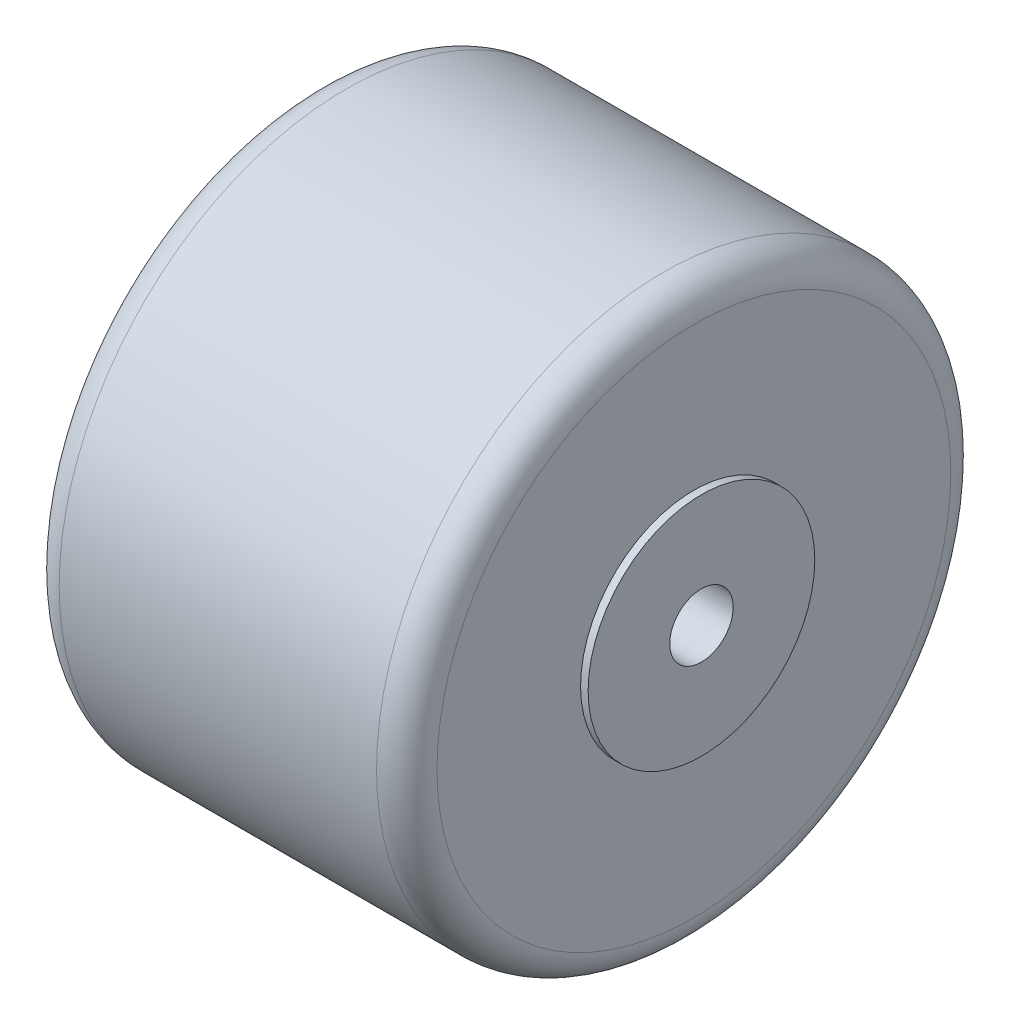
ISO-10303-21;
HEADER;
FILE_DESCRIPTION(('STEP AP214'),'2;1');
FILE_NAME('part.step','',(''),(''),'','','');
FILE_SCHEMA(('AUTOMOTIVE_DESIGN { 1 0 10303 214 1 1 1 1 }'));
ENDSEC;
DATA;
#1=APPLICATION_CONTEXT('core data for automotive mechanical design processes');
#2=APPLICATION_PROTOCOL_DEFINITION('international standard','automotive_design',2000,#1);
#3=PRODUCT_CONTEXT('',#1,'mechanical');
#4=PRODUCT('Part','Part','',(#3));
#5=PRODUCT_RELATED_PRODUCT_CATEGORY('part','',(#4));
#6=PRODUCT_DEFINITION_FORMATION('','',#4);
#7=PRODUCT_DEFINITION_CONTEXT('part definition',#1,'design');
#8=PRODUCT_DEFINITION('design','',#6,#7);
#9=PRODUCT_DEFINITION_SHAPE('','',#8);
#10=(LENGTH_UNIT() NAMED_UNIT(*) SI_UNIT(.MILLI.,.METRE.));
#11=(NAMED_UNIT(*) PLANE_ANGLE_UNIT() SI_UNIT($,.RADIAN.));
#12=(NAMED_UNIT(*) SI_UNIT($,.STERADIAN.) SOLID_ANGLE_UNIT());
#13=UNCERTAINTY_MEASURE_WITH_UNIT(LENGTH_MEASURE(1.E-05),#10,'distance_accuracy_value','');
#14=(GEOMETRIC_REPRESENTATION_CONTEXT(3) GLOBAL_UNCERTAINTY_ASSIGNED_CONTEXT((#13)) GLOBAL_UNIT_ASSIGNED_CONTEXT((#10,
#11,#12)) REPRESENTATION_CONTEXT('',''));
#15=CARTESIAN_POINT('',(0.,0.,0.));
#16=DIRECTION('',(0.,0.,1.));
#17=DIRECTION('',(1.,0.,0.));
#18=AXIS2_PLACEMENT_3D('',#15,#16,#17);
#19=CARTESIAN_POINT('',(26.,0.,0.));
#20=DIRECTION('',(-1.,0.,0.));
#21=DIRECTION('',(0.,0.,1.));
#22=AXIS2_PLACEMENT_3D('',#19,#20,#21);
#23=PLANE('',#22);
#24=CARTESIAN_POINT('',(26.,0.,0.));
#25=DIRECTION('',(1.,0.,0.));
#26=DIRECTION('',(0.,0.,-1.));
#27=AXIS2_PLACEMENT_3D('',#24,#25,#26);
#28=CIRCLE('',#27,2.09999999999999);
#29=CARTESIAN_POINT('',(26.,0.,-2.09999999999999));
#30=VERTEX_POINT('',#29);
#31=EDGE_CURVE('E61',#30,#30,#28,.T.);
#32=ORIENTED_EDGE('',*,*,#31,.F.);
#33=EDGE_LOOP('',(#32));
#34=FACE_BOUND('',#33,.T.);
#35=CARTESIAN_POINT('',(26.,0.,0.));
#36=DIRECTION('',(-1.,0.,0.));
#37=DIRECTION('',(0.,0.,1.));
#38=AXIS2_PLACEMENT_3D('',#35,#36,#37);
#39=CIRCLE('',#38,7.5);
#40=CARTESIAN_POINT('',(26.,0.,7.5));
#41=VERTEX_POINT('',#40);
#42=EDGE_CURVE('E57',#41,#41,#39,.T.);
#43=ORIENTED_EDGE('',*,*,#42,.F.);
#44=EDGE_LOOP('',(#43));
#45=FACE_BOUND('',#44,.T.);
#46=ADVANCED_FACE('F37',(#34,#45),#23,.F.);
#47=CARTESIAN_POINT('',(0.,0.,0.));
#48=DIRECTION('',(-1.,0.,0.));
#49=DIRECTION('',(0.,0.,1.));
#50=AXIS2_PLACEMENT_3D('',#47,#48,#49);
#51=CYLINDRICAL_SURFACE('',#50,7.5);
#52=CARTESIAN_POINT('',(25.5,0.,0.));
#53=DIRECTION('',(-1.,0.,0.));
#54=DIRECTION('',(0.,0.,1.));
#55=AXIS2_PLACEMENT_3D('',#52,#53,#54);
#56=CIRCLE('',#55,7.5);
#57=CARTESIAN_POINT('',(25.5,0.,7.5));
#58=VERTEX_POINT('',#57);
#59=EDGE_CURVE('E65',#58,#58,#56,.T.);
#60=ORIENTED_EDGE('',*,*,#59,.F.);
#61=EDGE_LOOP('',(#60));
#62=FACE_BOUND('',#61,.T.);
#63=ORIENTED_EDGE('',*,*,#42,.T.);
#64=EDGE_LOOP('',(#63));
#65=FACE_BOUND('',#64,.T.);
#66=ADVANCED_FACE('F111',(#62,#65),#51,.T.);
#67=CARTESIAN_POINT('',(25.5,7.5,0.));
#68=DIRECTION('',(-1.,0.,0.));
#69=DIRECTION('',(0.,0.,1.));
#70=AXIS2_PLACEMENT_3D('',#67,#68,#69);
#71=PLANE('',#70);
#72=CARTESIAN_POINT('',(25.5,0.,0.));
#73=DIRECTION('',(-1.,0.,0.));
#74=DIRECTION('',(0.,0.,1.));
#75=AXIS2_PLACEMENT_3D('',#72,#73,#74);
#76=CIRCLE('',#75,17.);
#77=CARTESIAN_POINT('',(25.5,0.,17.));
#78=VERTEX_POINT('',#77);
#79=EDGE_CURVE('E44',#78,#78,#76,.F.);
#80=ORIENTED_EDGE('',*,*,#79,.T.);
#81=EDGE_LOOP('',(#80));
#82=FACE_BOUND('',#81,.T.);
#83=ORIENTED_EDGE('',*,*,#59,.T.);
#84=EDGE_LOOP('',(#83));
#85=FACE_BOUND('',#84,.T.);
#86=ADVANCED_FACE('F107',(#82,#85),#71,.F.);
#87=CARTESIAN_POINT('',(0.,0.,0.));
#88=DIRECTION('',(-1.,0.,0.));
#89=DIRECTION('',(0.,0.,1.));
#90=AXIS2_PLACEMENT_3D('',#87,#88,#89);
#91=CYLINDRICAL_SURFACE('',#90,19.);
#92=CARTESIAN_POINT('',(23.5,0.,0.));
#93=DIRECTION('',(-1.,0.,0.));
#94=DIRECTION('',(0.,0.,1.));
#95=AXIS2_PLACEMENT_3D('',#92,#93,#94);
#96=CIRCLE('',#95,19.);
#97=CARTESIAN_POINT('',(23.5,0.,19.));
#98=VERTEX_POINT('',#97);
#99=EDGE_CURVE('E48',#98,#98,#96,.T.);
#100=ORIENTED_EDGE('',*,*,#99,.T.);
#101=EDGE_LOOP('',(#100));
#102=FACE_BOUND('',#101,.T.);
#103=CARTESIAN_POINT('',(2.5,0.,0.));
#104=DIRECTION('',(1.,0.,0.));
#105=DIRECTION('',(0.,0.,-1.));
#106=AXIS2_PLACEMENT_3D('',#103,#104,#105);
#107=CIRCLE('',#106,19.);
#108=CARTESIAN_POINT('',(2.5,0.,-19.));
#109=VERTEX_POINT('',#108);
#110=EDGE_CURVE('E52',#109,#109,#107,.T.);
#111=ORIENTED_EDGE('',*,*,#110,.T.);
#112=EDGE_LOOP('',(#111));
#113=FACE_BOUND('',#112,.T.);
#114=ADVANCED_FACE('F102',(#102,#113),#91,.T.);
#115=CARTESIAN_POINT('',(0.5,7.5,0.));
#116=DIRECTION('',(1.,0.,0.));
#117=DIRECTION('',(0.,0.,-1.));
#118=AXIS2_PLACEMENT_3D('',#115,#116,#117);
#119=PLANE('',#118);
#120=CARTESIAN_POINT('',(0.5,0.,0.));
#121=DIRECTION('',(1.,0.,0.));
#122=DIRECTION('',(0.,0.,-1.));
#123=AXIS2_PLACEMENT_3D('',#120,#121,#122);
#124=CIRCLE('',#123,17.);
#125=CARTESIAN_POINT('',(0.5,0.,-17.));
#126=VERTEX_POINT('',#125);
#127=EDGE_CURVE('E10',#126,#126,#124,.F.);
#128=ORIENTED_EDGE('',*,*,#127,.T.);
#129=EDGE_LOOP('',(#128));
#130=FACE_BOUND('',#129,.T.);
#131=CARTESIAN_POINT('',(0.5,0.,0.));
#132=DIRECTION('',(-1.,0.,0.));
#133=DIRECTION('',(0.,0.,1.));
#134=AXIS2_PLACEMENT_3D('',#131,#132,#133);
#135=CIRCLE('',#134,7.5);
#136=CARTESIAN_POINT('',(0.5,0.,7.5));
#137=VERTEX_POINT('',#136);
#138=EDGE_CURVE('E68',#137,#137,#135,.T.);
#139=ORIENTED_EDGE('',*,*,#138,.F.);
#140=EDGE_LOOP('',(#139));
#141=FACE_BOUND('',#140,.T.);
#142=ADVANCED_FACE('F97',(#130,#141),#119,.F.);
#143=CARTESIAN_POINT('',(0.,0.,0.));
#144=DIRECTION('',(-1.,0.,0.));
#145=DIRECTION('',(0.,0.,1.));
#146=AXIS2_PLACEMENT_3D('',#143,#144,#145);
#147=CYLINDRICAL_SURFACE('',#146,7.5);
#148=CARTESIAN_POINT('',(0.,0.,0.));
#149=DIRECTION('',(-1.,0.,0.));
#150=DIRECTION('',(0.,0.,1.));
#151=AXIS2_PLACEMENT_3D('',#148,#149,#150);
#152=CIRCLE('',#151,7.5);
#153=CARTESIAN_POINT('',(0.,0.,7.5));
#154=VERTEX_POINT('',#153);
#155=EDGE_CURVE('E71',#154,#154,#152,.T.);
#156=ORIENTED_EDGE('',*,*,#155,.F.);
#157=EDGE_LOOP('',(#156));
#158=FACE_BOUND('',#157,.T.);
#159=ORIENTED_EDGE('',*,*,#138,.T.);
#160=EDGE_LOOP('',(#159));
#161=FACE_BOUND('',#160,.T.);
#162=ADVANCED_FACE('F91',(#158,#161),#147,.T.);
#163=CARTESIAN_POINT('',(0.,0.,0.));
#164=DIRECTION('',(1.,0.,0.));
#165=DIRECTION('',(0.,0.,-1.));
#166=AXIS2_PLACEMENT_3D('',#163,#164,#165);
#167=PLANE('',#166);
#168=CARTESIAN_POINT('',(0.,0.,0.));
#169=DIRECTION('',(-1.,0.,0.));
#170=DIRECTION('',(0.,0.,1.));
#171=AXIS2_PLACEMENT_3D('',#168,#169,#170);
#172=CIRCLE('',#171,2.09999999999999);
#173=CARTESIAN_POINT('',(0.,0.,2.09999999999999));
#174=VERTEX_POINT('',#173);
#175=EDGE_CURVE('E81',#174,#174,#172,.T.);
#176=ORIENTED_EDGE('',*,*,#175,.F.);
#177=EDGE_LOOP('',(#176));
#178=FACE_BOUND('',#177,.T.);
#179=ORIENTED_EDGE('',*,*,#155,.T.);
#180=EDGE_LOOP('',(#179));
#181=FACE_BOUND('',#180,.T.);
#182=ADVANCED_FACE('F87',(#178,#181),#167,.F.);
#183=CARTESIAN_POINT('',(14.,0.,0.));
#184=DIRECTION('',(1.,0.,0.));
#185=DIRECTION('',(0.,0.,-1.));
#186=AXIS2_PLACEMENT_3D('',#183,#184,#185);
#187=CONICAL_SURFACE('',#186,2.1,1.02974425867665);
#188=CARTESIAN_POINT('',(13.,0.,0.));
#189=DIRECTION('',(-1.,0.,0.));
#190=DIRECTION('',(0.,0.,1.));
#191=AXIS2_PLACEMENT_3D('',#188,#189,#190);
#192=CIRCLE('',#191,0.435720517649475);
#193=CARTESIAN_POINT('',(13.,0.,0.435720517649475));
#194=VERTEX_POINT('',#193);
#195=EDGE_CURVE('E58',#194,#194,#192,.T.);
#196=ORIENTED_EDGE('',*,*,#195,.T.);
#197=EDGE_LOOP('',(#196));
#198=FACE_BOUND('',#197,.T.);
#199=CARTESIAN_POINT('',(14.,0.,0.));
#200=DIRECTION('',(1.,0.,0.));
#201=DIRECTION('',(0.,0.,-1.));
#202=AXIS2_PLACEMENT_3D('',#199,#200,#201);
#203=CIRCLE('',#202,2.1);
#204=CARTESIAN_POINT('',(14.,0.,-2.1));
#205=VERTEX_POINT('',#204);
#206=EDGE_CURVE('E74',#205,#205,#203,.T.);
#207=ORIENTED_EDGE('',*,*,#206,.T.);
#208=EDGE_LOOP('',(#207));
#209=FACE_BOUND('',#208,.T.);
#210=ADVANCED_FACE('F90',(#198,#209),#187,.F.);
#211=CARTESIAN_POINT('',(26.,0.,0.));
#212=DIRECTION('',(1.,0.,0.));
#213=DIRECTION('',(0.,0.,-1.));
#214=AXIS2_PLACEMENT_3D('',#211,#212,#213);
#215=CYLINDRICAL_SURFACE('',#214,2.09999999999999);
#216=ORIENTED_EDGE('',*,*,#206,.F.);
#217=EDGE_LOOP('',(#216));
#218=FACE_BOUND('',#217,.T.);
#219=ORIENTED_EDGE('',*,*,#31,.T.);
#220=EDGE_LOOP('',(#219));
#221=FACE_BOUND('',#220,.T.);
#222=ADVANCED_FACE('F141',(#218,#221),#215,.F.);
#223=CARTESIAN_POINT('',(12.,0.,0.));
#224=DIRECTION('',(-1.,0.,0.));
#225=DIRECTION('',(0.,0.,1.));
#226=AXIS2_PLACEMENT_3D('',#223,#224,#225);
#227=CONICAL_SURFACE('',#226,2.09999999999999,1.02974425867665);
#228=CARTESIAN_POINT('',(12.,0.,0.));
#229=DIRECTION('',(-1.,0.,0.));
#230=DIRECTION('',(0.,0.,1.));
#231=AXIS2_PLACEMENT_3D('',#228,#229,#230);
#232=CIRCLE('',#231,2.09999999999999);
#233=CARTESIAN_POINT('',(12.,0.,2.09999999999999));
#234=VERTEX_POINT('',#233);
#235=EDGE_CURVE('E62',#234,#234,#232,.T.);
#236=ORIENTED_EDGE('',*,*,#235,.T.);
#237=EDGE_LOOP('',(#236));
#238=FACE_BOUND('',#237,.T.);
#239=ORIENTED_EDGE('',*,*,#195,.F.);
#240=EDGE_LOOP('',(#239));
#241=FACE_BOUND('',#240,.T.);
#242=ADVANCED_FACE('F130',(#238,#241),#227,.F.);
#243=CARTESIAN_POINT('',(0.,0.,0.));
#244=DIRECTION('',(-1.,0.,0.));
#245=DIRECTION('',(0.,0.,1.));
#246=AXIS2_PLACEMENT_3D('',#243,#244,#245);
#247=CYLINDRICAL_SURFACE('',#246,2.09999999999999);
#248=ORIENTED_EDGE('',*,*,#235,.F.);
#249=EDGE_LOOP('',(#248));
#250=FACE_BOUND('',#249,.T.);
#251=ORIENTED_EDGE('',*,*,#175,.T.);
#252=EDGE_LOOP('',(#251));
#253=FACE_BOUND('',#252,.T.);
#254=ADVANCED_FACE('F85',(#250,#253),#247,.F.);
#255=CARTESIAN_POINT('',(23.5,0.,0.));
#256=DIRECTION('',(-1.,0.,0.));
#257=DIRECTION('',(0.,0.,1.));
#258=AXIS2_PLACEMENT_3D('',#255,#256,#257);
#259=TOROIDAL_SURFACE('',#258,17.,2.);
#260=ORIENTED_EDGE('',*,*,#79,.F.);
#261=EDGE_LOOP('',(#260));
#262=FACE_BOUND('',#261,.T.);
#263=ORIENTED_EDGE('',*,*,#99,.F.);
#264=EDGE_LOOP('',(#263));
#265=FACE_BOUND('',#264,.T.);
#266=ADVANCED_FACE('F122',(#262,#265),#259,.T.);
#267=CARTESIAN_POINT('',(2.5,0.,0.));
#268=DIRECTION('',(1.,0.,0.));
#269=DIRECTION('',(0.,0.,-1.));
#270=AXIS2_PLACEMENT_3D('',#267,#268,#269);
#271=TOROIDAL_SURFACE('',#270,17.,2.);
#272=ORIENTED_EDGE('',*,*,#110,.F.);
#273=EDGE_LOOP('',(#272));
#274=FACE_BOUND('',#273,.T.);
#275=ORIENTED_EDGE('',*,*,#127,.F.);
#276=EDGE_LOOP('',(#275));
#277=FACE_BOUND('',#276,.T.);
#278=ADVANCED_FACE('F39',(#274,#277),#271,.T.);
#279=CLOSED_SHELL('',(#46,#66,#86,#114,#142,#162,#182,#210,#222,#242,#254,#266,#278));
#280=MANIFOLD_SOLID_BREP('B2',#279);
#281=ADVANCED_BREP_SHAPE_REPRESENTATION('',(#18,#280),#14);
#282=SHAPE_DEFINITION_REPRESENTATION(#9,#281);
ENDSEC;
END-ISO-10303-21;
